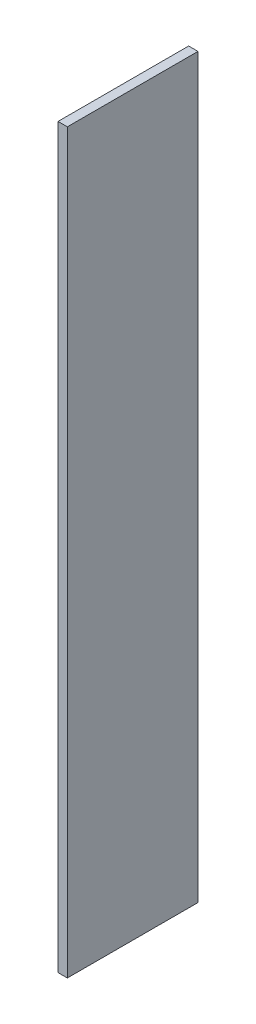
ISO-10303-21;
HEADER;
FILE_DESCRIPTION(('STEP AP214'),'2;1');
FILE_NAME('part.step','',(''),(''),'','','');
FILE_SCHEMA(('AUTOMOTIVE_DESIGN { 1 0 10303 214 1 1 1 1 }'));
ENDSEC;
DATA;
#1=APPLICATION_CONTEXT('core data for automotive mechanical design processes');
#2=APPLICATION_PROTOCOL_DEFINITION('international standard','automotive_design',2000,#1);
#3=PRODUCT_CONTEXT('',#1,'mechanical');
#4=PRODUCT('Part','Part','',(#3));
#5=PRODUCT_RELATED_PRODUCT_CATEGORY('part','',(#4));
#6=PRODUCT_DEFINITION_FORMATION('','',#4);
#7=PRODUCT_DEFINITION_CONTEXT('part definition',#1,'design');
#8=PRODUCT_DEFINITION('design','',#6,#7);
#9=PRODUCT_DEFINITION_SHAPE('','',#8);
#10=(LENGTH_UNIT() NAMED_UNIT(*) SI_UNIT(.MILLI.,.METRE.));
#11=(NAMED_UNIT(*) PLANE_ANGLE_UNIT() SI_UNIT($,.RADIAN.));
#12=(NAMED_UNIT(*) SI_UNIT($,.STERADIAN.) SOLID_ANGLE_UNIT());
#13=UNCERTAINTY_MEASURE_WITH_UNIT(LENGTH_MEASURE(1.E-05),#10,'distance_accuracy_value','');
#14=(GEOMETRIC_REPRESENTATION_CONTEXT(3) GLOBAL_UNCERTAINTY_ASSIGNED_CONTEXT((#13)) GLOBAL_UNIT_ASSIGNED_CONTEXT((#10,
#11,#12)) REPRESENTATION_CONTEXT('',''));
#15=CARTESIAN_POINT('',(0.,0.,0.));
#16=DIRECTION('',(0.,0.,1.));
#17=DIRECTION('',(1.,0.,0.));
#18=AXIS2_PLACEMENT_3D('',#15,#16,#17);
#19=CARTESIAN_POINT('',(6.35,0.,0.));
#20=DIRECTION('',(0.,0.,-1.));
#21=DIRECTION('',(-1.,0.,0.));
#22=AXIS2_PLACEMENT_3D('',#19,#20,#21);
#23=PLANE('',#22);
#24=DIRECTION('',(0.,-1.,0.));
#25=VECTOR('',#24,1.);
#26=CARTESIAN_POINT('',(0.,0.,0.));
#27=LINE('',#26,#25);
#28=CARTESIAN_POINT('',(0.,501.65,0.));
#29=VERTEX_POINT('',#28);
#30=CARTESIAN_POINT('',(0.,0.,0.));
#31=VERTEX_POINT('',#30);
#32=EDGE_CURVE('E100',#29,#31,#27,.T.);
#33=ORIENTED_EDGE('',*,*,#32,.T.);
#34=DIRECTION('',(-1.,0.,0.));
#35=VECTOR('',#34,1.);
#36=CARTESIAN_POINT('',(6.35,0.,0.));
#37=LINE('',#36,#35);
#38=CARTESIAN_POINT('',(6.35,0.,0.));
#39=VERTEX_POINT('',#38);
#40=EDGE_CURVE('E11',#39,#31,#37,.T.);
#41=ORIENTED_EDGE('',*,*,#40,.F.);
#42=DIRECTION('',(0.,-1.,0.));
#43=VECTOR('',#42,1.);
#44=CARTESIAN_POINT('',(6.35,0.,0.));
#45=LINE('',#44,#43);
#46=CARTESIAN_POINT('',(6.35,501.65,0.));
#47=VERTEX_POINT('',#46);
#48=EDGE_CURVE('E88',#47,#39,#45,.T.);
#49=ORIENTED_EDGE('',*,*,#48,.F.);
#50=DIRECTION('',(-1.,0.,0.));
#51=VECTOR('',#50,1.);
#52=CARTESIAN_POINT('',(6.35,501.65,0.));
#53=LINE('',#52,#51);
#54=EDGE_CURVE('E96',#47,#29,#53,.T.);
#55=ORIENTED_EDGE('',*,*,#54,.T.);
#56=EDGE_LOOP('',(#33,#41,#49,#55));
#57=FACE_BOUND('',#56,.T.);
#58=ADVANCED_FACE('F37',(#57),#23,.F.);
#59=CARTESIAN_POINT('',(6.35,0.,0.));
#60=DIRECTION('',(0.,1.,0.));
#61=DIRECTION('',(0.,0.,1.));
#62=AXIS2_PLACEMENT_3D('',#59,#60,#61);
#63=PLANE('',#62);
#64=DIRECTION('',(0.,0.,-1.));
#65=VECTOR('',#64,1.);
#66=CARTESIAN_POINT('',(0.,0.,0.));
#67=LINE('',#66,#65);
#68=CARTESIAN_POINT('',(0.,0.,-88.9));
#69=VERTEX_POINT('',#68);
#70=EDGE_CURVE('E92',#31,#69,#67,.T.);
#71=ORIENTED_EDGE('',*,*,#70,.T.);
#72=DIRECTION('',(-1.,0.,0.));
#73=VECTOR('',#72,1.);
#74=CARTESIAN_POINT('',(6.35,0.,-88.9));
#75=LINE('',#74,#73);
#76=CARTESIAN_POINT('',(6.35,0.,-88.9));
#77=VERTEX_POINT('',#76);
#78=EDGE_CURVE('E45',#77,#69,#75,.T.);
#79=ORIENTED_EDGE('',*,*,#78,.F.);
#80=DIRECTION('',(0.,0.,-1.));
#81=VECTOR('',#80,1.);
#82=CARTESIAN_POINT('',(6.35,0.,0.));
#83=LINE('',#82,#81);
#84=EDGE_CURVE('E83',#39,#77,#83,.T.);
#85=ORIENTED_EDGE('',*,*,#84,.F.);
#86=ORIENTED_EDGE('',*,*,#40,.T.);
#87=EDGE_LOOP('',(#71,#79,#85,#86));
#88=FACE_BOUND('',#87,.T.);
#89=ADVANCED_FACE('F91',(#88),#63,.F.);
#90=CARTESIAN_POINT('',(6.35,0.,-88.9));
#91=DIRECTION('',(0.,0.,1.));
#92=DIRECTION('',(1.,0.,0.));
#93=AXIS2_PLACEMENT_3D('',#90,#91,#92);
#94=PLANE('',#93);
#95=DIRECTION('',(0.,1.,0.));
#96=VECTOR('',#95,1.);
#97=CARTESIAN_POINT('',(0.,0.,-88.9));
#98=LINE('',#97,#96);
#99=CARTESIAN_POINT('',(0.,501.65,-88.9));
#100=VERTEX_POINT('',#99);
#101=EDGE_CURVE('E70',#69,#100,#98,.T.);
#102=ORIENTED_EDGE('',*,*,#101,.T.);
#103=DIRECTION('',(-1.,0.,0.));
#104=VECTOR('',#103,1.);
#105=CARTESIAN_POINT('',(6.35,501.65,-88.9));
#106=LINE('',#105,#104);
#107=CARTESIAN_POINT('',(6.35,501.65,-88.9));
#108=VERTEX_POINT('',#107);
#109=EDGE_CURVE('E93',#108,#100,#106,.T.);
#110=ORIENTED_EDGE('',*,*,#109,.F.);
#111=DIRECTION('',(0.,1.,0.));
#112=VECTOR('',#111,1.);
#113=CARTESIAN_POINT('',(6.35,0.,-88.9));
#114=LINE('',#113,#112);
#115=EDGE_CURVE('E86',#77,#108,#114,.T.);
#116=ORIENTED_EDGE('',*,*,#115,.F.);
#117=ORIENTED_EDGE('',*,*,#78,.T.);
#118=EDGE_LOOP('',(#102,#110,#116,#117));
#119=FACE_BOUND('',#118,.T.);
#120=ADVANCED_FACE('F94',(#119),#94,.F.);
#121=CARTESIAN_POINT('',(6.35,501.65,0.));
#122=DIRECTION('',(0.,-1.,0.));
#123=DIRECTION('',(0.,0.,-1.));
#124=AXIS2_PLACEMENT_3D('',#121,#122,#123);
#125=PLANE('',#124);
#126=DIRECTION('',(0.,0.,1.));
#127=VECTOR('',#126,1.);
#128=CARTESIAN_POINT('',(0.,501.65,0.));
#129=LINE('',#128,#127);
#130=EDGE_CURVE('E76',#100,#29,#129,.T.);
#131=ORIENTED_EDGE('',*,*,#130,.T.);
#132=ORIENTED_EDGE('',*,*,#54,.F.);
#133=DIRECTION('',(0.,0.,1.));
#134=VECTOR('',#133,1.);
#135=CARTESIAN_POINT('',(6.35,501.65,0.));
#136=LINE('',#135,#134);
#137=EDGE_CURVE('E53',#108,#47,#136,.T.);
#138=ORIENTED_EDGE('',*,*,#137,.F.);
#139=ORIENTED_EDGE('',*,*,#109,.T.);
#140=EDGE_LOOP('',(#131,#132,#138,#139));
#141=FACE_BOUND('',#140,.T.);
#142=ADVANCED_FACE('F107',(#141),#125,.F.);
#143=CARTESIAN_POINT('',(6.35,0.,0.));
#144=DIRECTION('',(-1.,0.,0.));
#145=DIRECTION('',(0.,0.,1.));
#146=AXIS2_PLACEMENT_3D('',#143,#144,#145);
#147=PLANE('',#146);
#148=ORIENTED_EDGE('',*,*,#48,.T.);
#149=ORIENTED_EDGE('',*,*,#84,.T.);
#150=ORIENTED_EDGE('',*,*,#115,.T.);
#151=ORIENTED_EDGE('',*,*,#137,.T.);
#152=EDGE_LOOP('',(#148,#149,#150,#151));
#153=FACE_BOUND('',#152,.T.);
#154=ADVANCED_FACE('F84',(#153),#147,.F.);
#155=CARTESIAN_POINT('',(0.,0.,0.));
#156=DIRECTION('',(-1.,0.,0.));
#157=DIRECTION('',(0.,0.,1.));
#158=AXIS2_PLACEMENT_3D('',#155,#156,#157);
#159=PLANE('',#158);
#160=ORIENTED_EDGE('',*,*,#32,.F.);
#161=ORIENTED_EDGE('',*,*,#130,.F.);
#162=ORIENTED_EDGE('',*,*,#101,.F.);
#163=ORIENTED_EDGE('',*,*,#70,.F.);
#164=EDGE_LOOP('',(#160,#161,#162,#163));
#165=FACE_BOUND('',#164,.T.);
#166=ADVANCED_FACE('F110',(#165),#159,.T.);
#167=CLOSED_SHELL('',(#58,#89,#120,#142,#154,#166));
#168=MANIFOLD_SOLID_BREP('B2',#167);
#169=ADVANCED_BREP_SHAPE_REPRESENTATION('',(#18,#168),#14);
#170=SHAPE_DEFINITION_REPRESENTATION(#9,#169);
ENDSEC;
END-ISO-10303-21;
